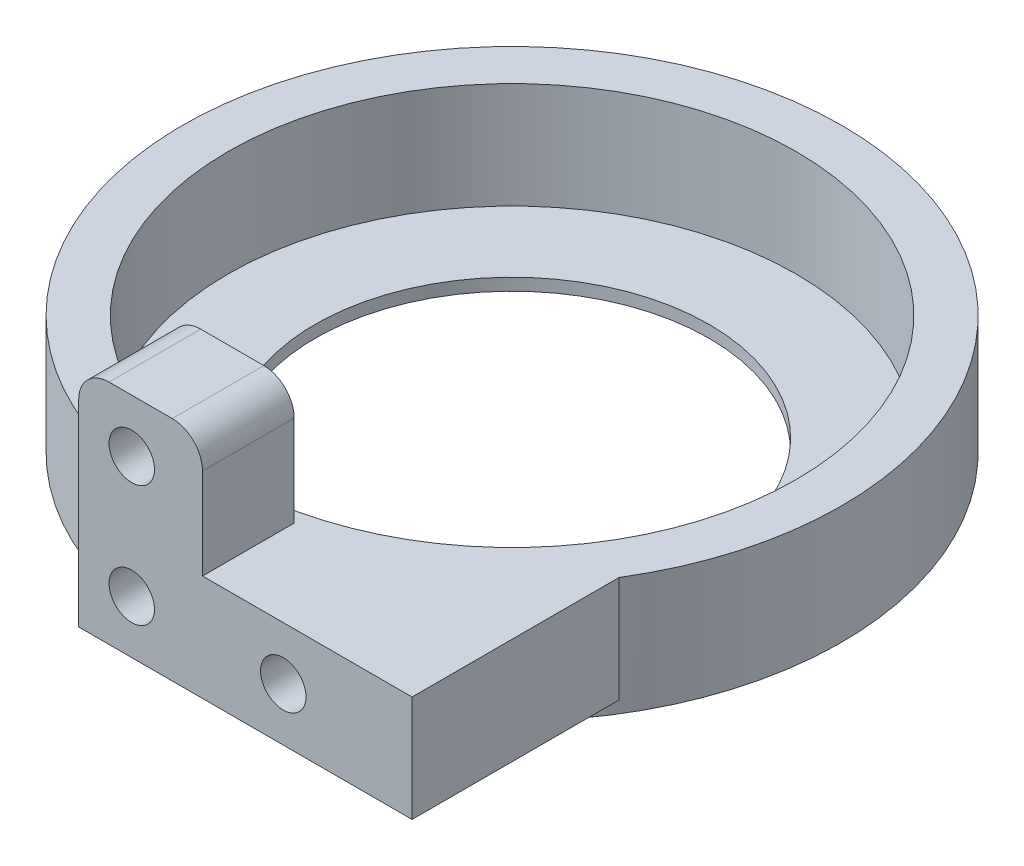
ISO-10303-21;
HEADER;
FILE_DESCRIPTION(('STEP AP214'),'2;1');
FILE_NAME('part.step','',(''),(''),'','','');
FILE_SCHEMA(('AUTOMOTIVE_DESIGN { 1 0 10303 214 1 1 1 1 }'));
ENDSEC;
DATA;
#1=APPLICATION_CONTEXT('core data for automotive mechanical design processes');
#2=APPLICATION_PROTOCOL_DEFINITION('international standard','automotive_design',2000,#1);
#3=PRODUCT_CONTEXT('',#1,'mechanical');
#4=PRODUCT('Part','Part','',(#3));
#5=PRODUCT_RELATED_PRODUCT_CATEGORY('part','',(#4));
#6=PRODUCT_DEFINITION_FORMATION('','',#4);
#7=PRODUCT_DEFINITION_CONTEXT('part definition',#1,'design');
#8=PRODUCT_DEFINITION('design','',#6,#7);
#9=PRODUCT_DEFINITION_SHAPE('','',#8);
#10=(LENGTH_UNIT() NAMED_UNIT(*) SI_UNIT(.MILLI.,.METRE.));
#11=(NAMED_UNIT(*) PLANE_ANGLE_UNIT() SI_UNIT($,.RADIAN.));
#12=(NAMED_UNIT(*) SI_UNIT($,.STERADIAN.) SOLID_ANGLE_UNIT());
#13=UNCERTAINTY_MEASURE_WITH_UNIT(LENGTH_MEASURE(1.E-05),#10,'distance_accuracy_value','');
#14=(GEOMETRIC_REPRESENTATION_CONTEXT(3) GLOBAL_UNCERTAINTY_ASSIGNED_CONTEXT((#13)) GLOBAL_UNIT_ASSIGNED_CONTEXT((#10,
#11,#12)) REPRESENTATION_CONTEXT('',''));
#15=CARTESIAN_POINT('',(0.,0.,0.));
#16=DIRECTION('',(0.,0.,1.));
#17=DIRECTION('',(1.,0.,0.));
#18=AXIS2_PLACEMENT_3D('',#15,#16,#17);
#19=CARTESIAN_POINT('',(0.,0.,0.));
#20=DIRECTION('',(0.,1.,0.));
#21=DIRECTION('',(0.,0.,1.));
#22=AXIS2_PLACEMENT_3D('',#19,#20,#21);
#23=PLANE('',#22);
#24=CARTESIAN_POINT('',(0.,0.,0.));
#25=DIRECTION('',(0.,-1.,0.));
#26=DIRECTION('',(0.,0.,-1.));
#27=AXIS2_PLACEMENT_3D('',#24,#25,#26);
#28=CIRCLE('',#27,21.75);
#29=CARTESIAN_POINT('',(18.5,0.,11.4373292336979));
#30=VERTEX_POINT('',#29);
#31=CARTESIAN_POINT('',(-3.5,0.,21.4665437367081));
#32=VERTEX_POINT('',#31);
#33=EDGE_CURVE('E193',#30,#32,#28,.T.);
#34=ORIENTED_EDGE('',*,*,#33,.F.);
#35=DIRECTION('',(0.,0.,-1.));
#36=VECTOR('',#35,1.);
#37=CARTESIAN_POINT('',(18.5,0.,25.1));
#38=LINE('',#37,#36);
#39=CARTESIAN_POINT('',(18.5,0.,25.1));
#40=VERTEX_POINT('',#39);
#41=EDGE_CURVE('E180',#40,#30,#38,.T.);
#42=ORIENTED_EDGE('',*,*,#41,.F.);
#43=DIRECTION('',(-1.,0.,0.));
#44=VECTOR('',#43,1.);
#45=CARTESIAN_POINT('',(3.5,0.,25.1));
#46=LINE('',#45,#44);
#47=CARTESIAN_POINT('',(-3.5,0.,25.1));
#48=VERTEX_POINT('',#47);
#49=EDGE_CURVE('E221',#40,#48,#46,.T.);
#50=ORIENTED_EDGE('',*,*,#49,.T.);
#51=DIRECTION('',(0.,0.,-1.));
#52=VECTOR('',#51,1.);
#53=CARTESIAN_POINT('',(-3.5,0.,25.1));
#54=LINE('',#53,#52);
#55=EDGE_CURVE('E212',#48,#32,#54,.T.);
#56=ORIENTED_EDGE('',*,*,#55,.T.);
#57=EDGE_LOOP('',(#34,#42,#50,#56));
#58=FACE_BOUND('',#57,.T.);
#59=ADVANCED_FACE('F57',(#58),#23,.F.);
#60=CARTESIAN_POINT('',(0.,7.,0.));
#61=DIRECTION('',(0.,1.,0.));
#62=DIRECTION('',(0.,0.,1.));
#63=AXIS2_PLACEMENT_3D('',#60,#61,#62);
#64=PLANE('',#63);
#65=DIRECTION('',(0.,0.,1.));
#66=VECTOR('',#65,1.);
#67=CARTESIAN_POINT('',(-3.5,7.,25.1));
#68=LINE('',#67,#66);
#69=CARTESIAN_POINT('',(-3.5,7.,19.0497576098352));
#70=VERTEX_POINT('',#69);
#71=CARTESIAN_POINT('',(-3.5,7.,21.4665437367081));
#72=VERTEX_POINT('',#71);
#73=EDGE_CURVE('E146',#70,#72,#68,.T.);
#74=ORIENTED_EDGE('',*,*,#73,.F.);
#75=DIRECTION('',(-1.,0.,0.));
#76=VECTOR('',#75,1.);
#77=CARTESIAN_POINT('',(-3.5,7.,19.0497576098352));
#78=LINE('',#77,#76);
#79=CARTESIAN_POINT('',(4.67120690078326,7.,19.0497576098352));
#80=VERTEX_POINT('',#79);
#81=EDGE_CURVE('E130',#80,#70,#78,.T.);
#82=ORIENTED_EDGE('',*,*,#81,.F.);
#83=DIRECTION('',(0.,0.,-1.));
#84=VECTOR('',#83,1.);
#85=CARTESIAN_POINT('',(4.67120690078326,7.,25.1));
#86=LINE('',#85,#84);
#87=CARTESIAN_POINT('',(4.67120690078326,7.,25.1));
#88=VERTEX_POINT('',#87);
#89=EDGE_CURVE('E143',#88,#80,#86,.T.);
#90=ORIENTED_EDGE('',*,*,#89,.F.);
#91=DIRECTION('',(-1.,0.,0.));
#92=VECTOR('',#91,1.);
#93=CARTESIAN_POINT('',(3.5,7.,25.1));
#94=LINE('',#93,#92);
#95=CARTESIAN_POINT('',(18.5,7.,25.1));
#96=VERTEX_POINT('',#95);
#97=EDGE_CURVE('E220',#96,#88,#94,.T.);
#98=ORIENTED_EDGE('',*,*,#97,.F.);
#99=DIRECTION('',(0.,0.,1.));
#100=VECTOR('',#99,1.);
#101=CARTESIAN_POINT('',(18.5,7.,25.1));
#102=LINE('',#101,#100);
#103=CARTESIAN_POINT('',(18.5,7.,11.4373292336979));
#104=VERTEX_POINT('',#103);
#105=EDGE_CURVE('E184',#104,#96,#102,.T.);
#106=ORIENTED_EDGE('',*,*,#105,.F.);
#107=CARTESIAN_POINT('',(0.,7.,0.));
#108=DIRECTION('',(0.,1.,0.));
#109=DIRECTION('',(0.,0.,1.));
#110=AXIS2_PLACEMENT_3D('',#107,#108,#109);
#111=CIRCLE('',#110,21.75);
#112=EDGE_CURVE('E217',#104,#72,#111,.T.);
#113=ORIENTED_EDGE('',*,*,#112,.T.);
#114=EDGE_LOOP('',(#74,#82,#90,#98,#106,#113));
#115=FACE_BOUND('',#114,.T.);
#116=CARTESIAN_POINT('',(0.,7.,0.));
#117=DIRECTION('',(0.,1.,0.));
#118=DIRECTION('',(0.,0.,1.));
#119=AXIS2_PLACEMENT_3D('',#116,#117,#118);
#120=CIRCLE('',#119,18.75);
#121=CARTESIAN_POINT('',(0.,7.,18.75));
#122=VERTEX_POINT('',#121);
#123=EDGE_CURVE('E208',#122,#122,#120,.T.);
#124=ORIENTED_EDGE('',*,*,#123,.F.);
#125=EDGE_LOOP('',(#124));
#126=FACE_BOUND('',#125,.T.);
#127=ADVANCED_FACE('F141',(#115,#126),#64,.T.);
#128=CARTESIAN_POINT('',(0.,7.,0.));
#129=DIRECTION('',(0.,-1.,0.));
#130=DIRECTION('',(0.,0.,-1.));
#131=AXIS2_PLACEMENT_3D('',#128,#129,#130);
#132=CYLINDRICAL_SURFACE('',#131,21.75);
#133=ORIENTED_EDGE('',*,*,#112,.F.);
#134=DIRECTION('',(0.,1.,0.));
#135=VECTOR('',#134,1.);
#136=CARTESIAN_POINT('',(18.5,0.,11.4373292336979));
#137=LINE('',#136,#135);
#138=EDGE_CURVE('E169',#30,#104,#137,.T.);
#139=ORIENTED_EDGE('',*,*,#138,.F.);
#140=ORIENTED_EDGE('',*,*,#33,.T.);
#141=DIRECTION('',(0.,-1.,0.));
#142=VECTOR('',#141,1.);
#143=CARTESIAN_POINT('',(-3.5,7.,21.4665437367081));
#144=LINE('',#143,#142);
#145=EDGE_CURVE('E233',#72,#32,#144,.T.);
#146=ORIENTED_EDGE('',*,*,#145,.F.);
#147=EDGE_LOOP('',(#133,#139,#140,#146));
#148=FACE_BOUND('',#147,.T.);
#149=CARTESIAN_POINT('',(0.,-0.8,0.));
#150=DIRECTION('',(0.,-1.,0.));
#151=DIRECTION('',(0.,0.,-1.));
#152=AXIS2_PLACEMENT_3D('',#149,#150,#151);
#153=CIRCLE('',#152,21.75);
#154=CARTESIAN_POINT('',(0.,-0.8,-21.75));
#155=VERTEX_POINT('',#154);
#156=EDGE_CURVE('E197',#155,#155,#153,.T.);
#157=ORIENTED_EDGE('',*,*,#156,.F.);
#158=EDGE_LOOP('',(#157));
#159=FACE_BOUND('',#158,.T.);
#160=ADVANCED_FACE('F304',(#148,#159),#132,.T.);
#161=CARTESIAN_POINT('',(-3.5,7.,25.1));
#162=DIRECTION('',(-1.,0.,0.));
#163=DIRECTION('',(0.,0.,1.));
#164=AXIS2_PLACEMENT_3D('',#161,#162,#163);
#165=PLANE('',#164);
#166=DIRECTION('',(0.,-1.,0.));
#167=VECTOR('',#166,1.);
#168=CARTESIAN_POINT('',(-3.5,7.,25.1));
#169=LINE('',#168,#167);
#170=CARTESIAN_POINT('',(-3.5,13.,25.1));
#171=VERTEX_POINT('',#170);
#172=EDGE_CURVE('E224',#171,#48,#169,.T.);
#173=ORIENTED_EDGE('',*,*,#172,.F.);
#174=DIRECTION('',(0.,0.,1.));
#175=VECTOR('',#174,1.);
#176=CARTESIAN_POINT('',(-3.5,13.,19.0497576098352));
#177=LINE('',#176,#175);
#178=CARTESIAN_POINT('',(-3.5,13.,19.0497576098352));
#179=VERTEX_POINT('',#178);
#180=EDGE_CURVE('E81',#171,#179,#177,.F.);
#181=ORIENTED_EDGE('',*,*,#180,.T.);
#182=DIRECTION('',(0.,-1.,0.));
#183=VECTOR('',#182,1.);
#184=CARTESIAN_POINT('',(-3.5,15.,19.0497576098352));
#185=LINE('',#184,#183);
#186=EDGE_CURVE('E136',#179,#70,#185,.T.);
#187=ORIENTED_EDGE('',*,*,#186,.T.);
#188=ORIENTED_EDGE('',*,*,#73,.T.);
#189=ORIENTED_EDGE('',*,*,#145,.T.);
#190=ORIENTED_EDGE('',*,*,#55,.F.);
#191=EDGE_LOOP('',(#173,#181,#187,#188,#189,#190));
#192=FACE_BOUND('',#191,.T.);
#193=ADVANCED_FACE('F309',(#192),#165,.T.);
#194=CARTESIAN_POINT('',(3.5,7.,25.1));
#195=DIRECTION('',(0.,0.,1.));
#196=DIRECTION('',(1.,0.,0.));
#197=AXIS2_PLACEMENT_3D('',#194,#195,#196);
#198=PLANE('',#197);
#199=CARTESIAN_POINT('',(0.,11.5,25.1));
#200=DIRECTION('',(0.,0.,1.));
#201=DIRECTION('',(1.,0.,0.));
#202=AXIS2_PLACEMENT_3D('',#199,#200,#201);
#203=CIRCLE('',#202,1.5);
#204=CARTESIAN_POINT('',(1.5,11.5,25.1));
#205=VERTEX_POINT('',#204);
#206=EDGE_CURVE('E543',#205,#205,#203,.T.);
#207=ORIENTED_EDGE('',*,*,#206,.F.);
#208=EDGE_LOOP('',(#207));
#209=FACE_BOUND('',#208,.T.);
#210=CARTESIAN_POINT('',(10.,3.5,25.1));
#211=DIRECTION('',(0.,0.,1.));
#212=DIRECTION('',(1.,0.,0.));
#213=AXIS2_PLACEMENT_3D('',#210,#211,#212);
#214=CIRCLE('',#213,1.5);
#215=CARTESIAN_POINT('',(11.5,3.5,25.1));
#216=VERTEX_POINT('',#215);
#217=EDGE_CURVE('E164',#216,#216,#214,.T.);
#218=ORIENTED_EDGE('',*,*,#217,.F.);
#219=EDGE_LOOP('',(#218));
#220=FACE_BOUND('',#219,.T.);
#221=DIRECTION('',(1.,0.,0.));
#222=VECTOR('',#221,1.);
#223=CARTESIAN_POINT('',(-3.5,15.,25.1));
#224=LINE('',#223,#222);
#225=CARTESIAN_POINT('',(-1.5,15.,25.1));
#226=VERTEX_POINT('',#225);
#227=CARTESIAN_POINT('',(2.67120690078326,15.,25.1));
#228=VERTEX_POINT('',#227);
#229=EDGE_CURVE('E148',#226,#228,#224,.T.);
#230=ORIENTED_EDGE('',*,*,#229,.F.);
#231=CARTESIAN_POINT('',(-1.5,13.,25.1));
#232=DIRECTION('',(0.,0.,1.));
#233=DIRECTION('',(1.,0.,0.));
#234=AXIS2_PLACEMENT_3D('',#231,#232,#233);
#235=CIRCLE('',#234,2.);
#236=EDGE_CURVE('E520',#226,#171,#235,.T.);
#237=ORIENTED_EDGE('',*,*,#236,.T.);
#238=ORIENTED_EDGE('',*,*,#172,.T.);
#239=ORIENTED_EDGE('',*,*,#49,.F.);
#240=DIRECTION('',(0.,-1.,0.));
#241=VECTOR('',#240,1.);
#242=CARTESIAN_POINT('',(18.5,7.,25.1));
#243=LINE('',#242,#241);
#244=EDGE_CURVE('E176',#96,#40,#243,.T.);
#245=ORIENTED_EDGE('',*,*,#244,.F.);
#246=ORIENTED_EDGE('',*,*,#97,.T.);
#247=DIRECTION('',(0.,-1.,0.));
#248=VECTOR('',#247,1.);
#249=CARTESIAN_POINT('',(4.67120690078326,15.,25.1));
#250=LINE('',#249,#248);
#251=CARTESIAN_POINT('',(4.67120690078326,13.,25.1));
#252=VERTEX_POINT('',#251);
#253=EDGE_CURVE('E135',#252,#88,#250,.T.);
#254=ORIENTED_EDGE('',*,*,#253,.F.);
#255=CARTESIAN_POINT('',(2.67120690078326,13.,25.1));
#256=DIRECTION('',(0.,0.,1.));
#257=DIRECTION('',(1.,0.,0.));
#258=AXIS2_PLACEMENT_3D('',#255,#256,#257);
#259=CIRCLE('',#258,2.);
#260=EDGE_CURVE('E514',#252,#228,#259,.T.);
#261=ORIENTED_EDGE('',*,*,#260,.T.);
#262=EDGE_LOOP('',(#230,#237,#238,#239,#245,#246,#254,#261));
#263=FACE_BOUND('',#262,.T.);
#264=CARTESIAN_POINT('',(0.,3.5,25.1));
#265=DIRECTION('',(0.,0.,1.));
#266=DIRECTION('',(1.,0.,0.));
#267=AXIS2_PLACEMENT_3D('',#264,#265,#266);
#268=CIRCLE('',#267,1.5);
#269=CARTESIAN_POINT('',(1.5,3.5,25.1));
#270=VERTEX_POINT('',#269);
#271=EDGE_CURVE('E201',#270,#270,#268,.T.);
#272=ORIENTED_EDGE('',*,*,#271,.F.);
#273=EDGE_LOOP('',(#272));
#274=FACE_BOUND('',#273,.T.);
#275=ADVANCED_FACE('F306',(#209,#220,#263,#274),#198,.T.);
#276=CARTESIAN_POINT('',(0.,7.,0.));
#277=DIRECTION('',(0.,-1.,0.));
#278=DIRECTION('',(0.,0.,-1.));
#279=AXIS2_PLACEMENT_3D('',#276,#277,#278);
#280=CYLINDRICAL_SURFACE('',#279,18.75);
#281=CARTESIAN_POINT('',(1.5,3.5,18.6899036915657));
#282=CARTESIAN_POINT('',(1.49999632062772,3.41588910974437,18.6899044892014));
#283=CARTESIAN_POINT('',(1.49290156215183,3.3317206652062,18.6904775942158));
#284=CARTESIAN_POINT('',(1.46470318774386,3.16571175768858,18.6927081206783));
#285=CARTESIAN_POINT('',(1.44358362109166,3.08387405616433,18.6943667767162));
#286=CARTESIAN_POINT('',(1.38794959023862,2.92495508136651,18.6985793452206));
#287=CARTESIAN_POINT('',(1.35344262614257,2.84787117282067,18.7011327563356));
#288=CARTESIAN_POINT('',(1.27202646042832,2.70060821925846,18.7068465005001));
#289=CARTESIAN_POINT('',(1.22511994393665,2.630427683824,18.7100067021084));
#290=CARTESIAN_POINT('',(1.12011551831489,2.49877819168836,18.7165863916315));
#291=CARTESIAN_POINT('',(1.06199424933048,2.43732789187484,18.7200064115608));
#292=CARTESIAN_POINT('',(0.936259445760343,2.32504341460093,18.7267155033906));
#293=CARTESIAN_POINT('',(0.868645500088394,2.27420969713547,18.7300045696121));
#294=CARTESIAN_POINT('',(0.725734168475946,2.18453992472742,18.7360861453358));
#295=CARTESIAN_POINT('',(0.650426681655086,2.14571991903267,18.738877988498));
#296=CARTESIAN_POINT('',(0.494336491088885,2.08128219450257,18.7436448358792));
#297=CARTESIAN_POINT('',(0.413553876517281,2.05566426070272,18.745619853398));
#298=CARTESIAN_POINT('',(0.248991495760869,2.01841132760336,18.7485268054688));
#299=CARTESIAN_POINT('',(0.165218575252358,2.00674626571047,18.7494609822974));
#300=CARTESIAN_POINT('',(-0.00310101422522166,1.99763728747693,18.7501885880184));
#301=CARTESIAN_POINT('',(-0.0876476697940369,2.00019312530925,18.7499820366297));
#302=CARTESIAN_POINT('',(-0.254910958845742,2.01942877416144,18.7484533122186));
#303=CARTESIAN_POINT('',(-0.337631336820587,2.03607625616637,18.7471336928186));
#304=CARTESIAN_POINT('',(-0.499099950189813,2.08297238129014,18.7435302217384));
#305=CARTESIAN_POINT('',(-0.577848150305161,2.11322114518559,18.7412463614959));
#306=CARTESIAN_POINT('',(-0.729240075628612,2.18649731782168,18.7359669873138));
#307=CARTESIAN_POINT('',(-0.801876748665349,2.22953923615441,18.7329706660993));
#308=CARTESIAN_POINT('',(-0.938906754389632,2.32716937813201,18.7266031809033));
#309=CARTESIAN_POINT('',(-1.00329993315168,2.38175781732721,18.7232320099247));
#310=CARTESIAN_POINT('',(-1.12220402922705,2.50111371219672,18.716482638835));
#311=CARTESIAN_POINT('',(-1.17668675797546,2.56590925405083,18.7131044454878));
#312=CARTESIAN_POINT('',(-1.27400569041641,2.70374207490187,18.7067312907922));
#313=CARTESIAN_POINT('',(-1.31684188556444,2.77677935994532,18.7037363297249));
#314=CARTESIAN_POINT('',(-1.38965054864154,2.92904186429338,18.6984681334495));
#315=CARTESIAN_POINT('',(-1.41962160308561,3.00826776240737,18.6961949775527));
#316=CARTESIAN_POINT('',(-1.46582859989257,3.17064933913142,18.6926292502436));
#317=CARTESIAN_POINT('',(-1.48206480809471,3.25380494164879,18.6913366598524));
#318=CARTESIAN_POINT('',(-1.50030564278629,3.4214389223715,18.6898814380755));
#319=CARTESIAN_POINT('',(-1.50234955607957,3.50591299971711,18.6897156874231));
#320=CARTESIAN_POINT('',(-1.49225064585172,3.67400262104635,18.690524676209));
#321=CARTESIAN_POINT('',(-1.48010794413208,3.75761817239478,18.6914994058556));
#322=CARTESIAN_POINT('',(-1.44201322164018,3.92150472101421,18.6944766801575));
#323=CARTESIAN_POINT('',(-1.41607949196744,4.00177999680187,18.6964778632987));
#324=CARTESIAN_POINT('',(-1.35115745890298,4.15683972413565,18.7012814234103));
#325=CARTESIAN_POINT('',(-1.31216896221481,4.23162409436024,18.7040838122436));
#326=CARTESIAN_POINT('',(-1.22214454706965,4.373759059463,18.7101815822911));
#327=CARTESIAN_POINT('',(-1.17108242281578,4.44109300986021,18.7134780300796));
#328=CARTESIAN_POINT('',(-1.05839811840015,4.5662476479122,18.7201888557784));
#329=CARTESIAN_POINT('',(-0.996775770633618,4.62406818454792,18.7236032355598));
#330=CARTESIAN_POINT('',(-0.864550602263586,4.72868853250665,18.7301744660023));
#331=CARTESIAN_POINT('',(-0.793927565253147,4.77546283652398,18.7333307098241));
#332=CARTESIAN_POINT('',(-0.645806640765806,4.85648803992158,18.7390213036078));
#333=CARTESIAN_POINT('',(-0.568308817352759,4.89073905598699,18.7415556593639));
#334=CARTESIAN_POINT('',(-0.408730022480179,4.94570151548968,18.7457141148762));
#335=CARTESIAN_POINT('',(-0.326654535286603,4.96642879824313,18.7473392791795));
#336=CARTESIAN_POINT('',(-0.160174833719194,4.99380720003187,18.7495005498768));
#337=CARTESIAN_POINT('',(-0.0757706596510529,5.00045856254326,18.7500366751083));
#338=CARTESIAN_POINT('',(0.0927188866521085,4.99949357241986,18.7499594956931));
#339=CARTESIAN_POINT('',(0.176804491059185,4.99191700058234,18.7493493958487));
#340=CARTESIAN_POINT('',(0.342505049325764,4.96279408533884,18.7470546664287));
#341=CARTESIAN_POINT('',(0.424119999621,4.94124772178048,18.7453700353031));
#342=CARTESIAN_POINT('',(0.58256563894844,4.88480677611825,18.7411153164152));
#343=CARTESIAN_POINT('',(0.6593965525984,4.8499128212543,18.7385452702617));
#344=CARTESIAN_POINT('',(0.806115934271487,4.76777187152803,18.7328074295552));
#345=CARTESIAN_POINT('',(0.8760045245382,4.72052509423304,18.7296396455302));
#346=CARTESIAN_POINT('',(1.00705879886138,4.61487049786707,18.7230514806532));
#347=CARTESIAN_POINT('',(1.06820077293534,4.55643330967203,18.7196304499822));
#348=CARTESIAN_POINT('',(1.17983224819666,4.43010829215942,18.7129268703636));
#349=CARTESIAN_POINT('',(1.23031916134281,4.36221817342083,18.709644355215));
#350=CARTESIAN_POINT('',(1.31927004620408,4.21879254913323,18.7035831840147));
#351=CARTESIAN_POINT('',(1.35771272607774,4.14324381313022,18.7008054238702));
#352=CARTESIAN_POINT('',(1.42131855200279,3.98679387767989,18.6960792751499));
#353=CARTESIAN_POINT('',(1.44649701682099,3.90589897459956,18.6941299303474));
#354=CARTESIAN_POINT('',(1.47642337958161,3.77043630193827,18.691784377361));
#355=CARTESIAN_POINT('',(1.48525291732771,3.71674059854125,18.6910823459044));
#356=CARTESIAN_POINT('',(1.49704240943925,3.60870461027899,18.6901417457999));
#357=CARTESIAN_POINT('',(1.5000023781296,3.55436432698718,18.6899031760209));
#358=CARTESIAN_POINT('',(1.5,3.5,18.6899036915657));
#359=B_SPLINE_CURVE_WITH_KNOTS('',3,(#281,#282,#283,#284,#285,#286,#287,#288,#289,#290,#291,
#292,#293,#294,#295,#296,#297,#298,#299,#300,#301,#302,#303,#304,#305,#306,#307,#308,#309,#310,
#311,#312,#313,#314,#315,#316,#317,#318,#319,#320,#321,#322,#323,#324,#325,#326,#327,#328,#329,
#330,#331,#332,#333,#334,#335,#336,#337,#338,#339,#340,#341,#342,#343,#344,#345,#346,#347,#348,
#349,#350,#351,#352,#353,#354,#355,#356,#357,#358),.UNSPECIFIED.,.T.,.F.,(4,2,2,2,2,2,2,2,2,2,2,
2,2,2,2,2,2,2,2,2,2,2,2,2,2,2,2,2,2,2,2,2,2,2,2,2,2,2,4),(0.,0.25213418203791,0.50455561402385,
0.756835834120728,1.00906146755583,1.26181826116902,1.51458600394927,1.7676899785965,
2.02078983191417,2.27334337309686,2.52589254857181,2.77786389180794,3.02983747254223,
3.28209793140011,3.53436309986935,3.78733494058949,4.0403069669025,4.29330677998519,
4.54630169612057,4.79859599700462,5.05088813179099,5.30284648195618,5.55480856292754,
5.80732263043169,6.05984070604075,6.31293630132195,6.56602953833693,6.8188258119051,
7.07161771273227,7.32370386856552,7.5757903880512,7.82786506275495,8.07993529802616,
8.33267638790938,8.5854787963961,8.83872562068804,9.09167932690653,9.25464441416333,
9.41760910369755),.UNSPECIFIED.);
#360=CARTESIAN_POINT('',(1.5,3.5,18.6899036915657));
#361=VERTEX_POINT('',#360);
#362=EDGE_CURVE('E207',#361,#361,#359,.T.);
#363=ORIENTED_EDGE('',*,*,#362,.F.);
#364=EDGE_LOOP('',(#363));
#365=FACE_BOUND('',#364,.T.);
#366=ORIENTED_EDGE('',*,*,#123,.T.);
#367=EDGE_LOOP('',(#366));
#368=FACE_BOUND('',#367,.T.);
#369=CARTESIAN_POINT('',(0.,0.,0.));
#370=DIRECTION('',(0.,1.,0.));
#371=DIRECTION('',(0.,0.,1.));
#372=AXIS2_PLACEMENT_3D('',#369,#370,#371);
#373=CIRCLE('',#372,18.75);
#374=CARTESIAN_POINT('',(0.,0.,18.75));
#375=VERTEX_POINT('',#374);
#376=EDGE_CURVE('E213',#375,#375,#373,.T.);
#377=ORIENTED_EDGE('',*,*,#376,.F.);
#378=EDGE_LOOP('',(#377));
#379=FACE_BOUND('',#378,.T.);
#380=ADVANCED_FACE('F247',(#365,#368,#379),#280,.F.);
#381=CARTESIAN_POINT('',(0.,3.5,18.1));
#382=DIRECTION('',(0.,0.,1.));
#383=DIRECTION('',(1.,0.,0.));
#384=AXIS2_PLACEMENT_3D('',#381,#382,#383);
#385=CYLINDRICAL_SURFACE('',#384,1.5);
#386=ORIENTED_EDGE('',*,*,#362,.T.);
#387=EDGE_LOOP('',(#386));
#388=FACE_BOUND('',#387,.T.);
#389=ORIENTED_EDGE('',*,*,#271,.T.);
#390=EDGE_LOOP('',(#389));
#391=FACE_BOUND('',#390,.T.);
#392=ADVANCED_FACE('F250',(#388,#391),#385,.F.);
#393=CARTESIAN_POINT('',(0.,0.,0.));
#394=DIRECTION('',(0.,-1.,0.));
#395=DIRECTION('',(0.,0.,-1.));
#396=AXIS2_PLACEMENT_3D('',#393,#394,#395);
#397=PLANE('',#396);
#398=CARTESIAN_POINT('',(0.,0.,0.));
#399=DIRECTION('',(0.,-1.,0.));
#400=DIRECTION('',(0.,0.,-1.));
#401=AXIS2_PLACEMENT_3D('',#398,#399,#400);
#402=CIRCLE('',#401,13.);
#403=CARTESIAN_POINT('',(0.,0.,-13.));
#404=VERTEX_POINT('',#403);
#405=EDGE_CURVE('E188',#404,#404,#402,.T.);
#406=ORIENTED_EDGE('',*,*,#405,.T.);
#407=EDGE_LOOP('',(#406));
#408=FACE_BOUND('',#407,.T.);
#409=ORIENTED_EDGE('',*,*,#376,.T.);
#410=EDGE_LOOP('',(#409));
#411=FACE_BOUND('',#410,.T.);
#412=ADVANCED_FACE('F254',(#408,#411),#397,.F.);
#413=CARTESIAN_POINT('',(0.,-0.8,0.));
#414=DIRECTION('',(0.,-1.,0.));
#415=DIRECTION('',(0.,0.,-1.));
#416=AXIS2_PLACEMENT_3D('',#413,#414,#415);
#417=PLANE('',#416);
#418=ORIENTED_EDGE('',*,*,#156,.T.);
#419=EDGE_LOOP('',(#418));
#420=FACE_BOUND('',#419,.T.);
#421=CARTESIAN_POINT('',(0.,-0.8,0.));
#422=DIRECTION('',(0.,-1.,0.));
#423=DIRECTION('',(0.,0.,-1.));
#424=AXIS2_PLACEMENT_3D('',#421,#422,#423);
#425=CIRCLE('',#424,13.);
#426=CARTESIAN_POINT('',(0.,-0.8,-13.));
#427=VERTEX_POINT('',#426);
#428=EDGE_CURVE('E189',#427,#427,#425,.T.);
#429=ORIENTED_EDGE('',*,*,#428,.F.);
#430=EDGE_LOOP('',(#429));
#431=FACE_BOUND('',#430,.T.);
#432=ADVANCED_FACE('F258',(#420,#431),#417,.T.);
#433=CARTESIAN_POINT('',(0.,-0.8,0.));
#434=DIRECTION('',(0.,1.,0.));
#435=DIRECTION('',(0.,0.,1.));
#436=AXIS2_PLACEMENT_3D('',#433,#434,#435);
#437=CYLINDRICAL_SURFACE('',#436,13.);
#438=ORIENTED_EDGE('',*,*,#428,.T.);
#439=EDGE_LOOP('',(#438));
#440=FACE_BOUND('',#439,.T.);
#441=ORIENTED_EDGE('',*,*,#405,.F.);
#442=EDGE_LOOP('',(#441));
#443=FACE_BOUND('',#442,.T.);
#444=ADVANCED_FACE('F262',(#440,#443),#437,.F.);
#445=CARTESIAN_POINT('',(18.5,0.,0.));
#446=DIRECTION('',(1.,0.,0.));
#447=DIRECTION('',(0.,0.,-1.));
#448=AXIS2_PLACEMENT_3D('',#445,#446,#447);
#449=PLANE('',#448);
#450=ORIENTED_EDGE('',*,*,#244,.T.);
#451=ORIENTED_EDGE('',*,*,#41,.T.);
#452=ORIENTED_EDGE('',*,*,#138,.T.);
#453=ORIENTED_EDGE('',*,*,#105,.T.);
#454=EDGE_LOOP('',(#450,#451,#452,#453));
#455=FACE_BOUND('',#454,.T.);
#456=ADVANCED_FACE('F266',(#455),#449,.T.);
#457=CARTESIAN_POINT('',(10.,3.5,19.1));
#458=DIRECTION('',(0.,0.,1.));
#459=DIRECTION('',(1.,0.,0.));
#460=AXIS2_PLACEMENT_3D('',#457,#458,#459);
#461=CYLINDRICAL_SURFACE('',#460,1.5);
#462=CARTESIAN_POINT('',(10.,3.5,19.1));
#463=DIRECTION('',(0.,0.,1.));
#464=DIRECTION('',(1.,0.,0.));
#465=AXIS2_PLACEMENT_3D('',#462,#463,#464);
#466=CIRCLE('',#465,1.5);
#467=CARTESIAN_POINT('',(11.5,3.5,19.1));
#468=VERTEX_POINT('',#467);
#469=EDGE_CURVE('E165',#468,#468,#466,.T.);
#470=ORIENTED_EDGE('',*,*,#469,.F.);
#471=EDGE_LOOP('',(#470));
#472=FACE_BOUND('',#471,.T.);
#473=ORIENTED_EDGE('',*,*,#217,.T.);
#474=EDGE_LOOP('',(#473));
#475=FACE_BOUND('',#474,.T.);
#476=ADVANCED_FACE('F270',(#472,#475),#461,.F.);
#477=CARTESIAN_POINT('',(10.,3.5,19.1));
#478=DIRECTION('',(0.,0.,1.));
#479=DIRECTION('',(1.,0.,0.));
#480=AXIS2_PLACEMENT_3D('',#477,#478,#479);
#481=PLANE('',#480);
#482=ORIENTED_EDGE('',*,*,#469,.T.);
#483=EDGE_LOOP('',(#482));
#484=FACE_BOUND('',#483,.T.);
#485=ADVANCED_FACE('F274',(#484),#481,.T.);
#486=CARTESIAN_POINT('',(4.67120690078326,15.,25.1));
#487=DIRECTION('',(-1.,0.,0.));
#488=DIRECTION('',(0.,0.,1.));
#489=AXIS2_PLACEMENT_3D('',#486,#487,#488);
#490=PLANE('',#489);
#491=DIRECTION('',(0.,-1.,0.));
#492=VECTOR('',#491,1.);
#493=CARTESIAN_POINT('',(4.67120690078326,15.,19.0497576098352));
#494=LINE('',#493,#492);
#495=CARTESIAN_POINT('',(4.67120690078326,13.,19.0497576098352));
#496=VERTEX_POINT('',#495);
#497=EDGE_CURVE('E127',#496,#80,#494,.T.);
#498=ORIENTED_EDGE('',*,*,#497,.F.);
#499=DIRECTION('',(0.,0.,-1.));
#500=VECTOR('',#499,1.);
#501=CARTESIAN_POINT('',(4.67120690078326,13.,25.1));
#502=LINE('',#501,#500);
#503=EDGE_CURVE('E12',#496,#252,#502,.F.);
#504=ORIENTED_EDGE('',*,*,#503,.T.);
#505=ORIENTED_EDGE('',*,*,#253,.T.);
#506=ORIENTED_EDGE('',*,*,#89,.T.);
#507=EDGE_LOOP('',(#498,#504,#505,#506));
#508=FACE_BOUND('',#507,.T.);
#509=ADVANCED_FACE('F150',(#508),#490,.F.);
#510=CARTESIAN_POINT('',(-3.5,15.,19.0497576098352));
#511=DIRECTION('',(0.,0.,1.));
#512=DIRECTION('',(1.,0.,0.));
#513=AXIS2_PLACEMENT_3D('',#510,#511,#512);
#514=PLANE('',#513);
#515=CARTESIAN_POINT('',(0.,11.5,19.0497576098352));
#516=DIRECTION('',(0.,0.,1.));
#517=DIRECTION('',(1.,0.,0.));
#518=AXIS2_PLACEMENT_3D('',#515,#516,#517);
#519=CIRCLE('',#518,1.5);
#520=CARTESIAN_POINT('',(1.5,11.5,19.0497576098352));
#521=VERTEX_POINT('',#520);
#522=EDGE_CURVE('E155',#521,#521,#519,.T.);
#523=ORIENTED_EDGE('',*,*,#522,.T.);
#524=EDGE_LOOP('',(#523));
#525=FACE_BOUND('',#524,.T.);
#526=ORIENTED_EDGE('',*,*,#186,.F.);
#527=CARTESIAN_POINT('',(-1.5,13.,19.0497576098352));
#528=DIRECTION('',(0.,0.,1.));
#529=DIRECTION('',(1.,0.,0.));
#530=AXIS2_PLACEMENT_3D('',#527,#528,#529);
#531=CIRCLE('',#530,2.);
#532=CARTESIAN_POINT('',(-1.5,15.,19.0497576098352));
#533=VERTEX_POINT('',#532);
#534=EDGE_CURVE('E66',#179,#533,#531,.F.);
#535=ORIENTED_EDGE('',*,*,#534,.T.);
#536=DIRECTION('',(-1.,0.,0.));
#537=VECTOR('',#536,1.);
#538=CARTESIAN_POINT('',(-3.5,15.,19.0497576098352));
#539=LINE('',#538,#537);
#540=CARTESIAN_POINT('',(2.67120690078326,15.,19.0497576098352));
#541=VERTEX_POINT('',#540);
#542=EDGE_CURVE('E160',#541,#533,#539,.T.);
#543=ORIENTED_EDGE('',*,*,#542,.F.);
#544=CARTESIAN_POINT('',(2.67120690078326,13.,19.0497576098352));
#545=DIRECTION('',(0.,0.,1.));
#546=DIRECTION('',(1.,0.,0.));
#547=AXIS2_PLACEMENT_3D('',#544,#545,#546);
#548=CIRCLE('',#547,2.);
#549=EDGE_CURVE('E73',#541,#496,#548,.F.);
#550=ORIENTED_EDGE('',*,*,#549,.T.);
#551=ORIENTED_EDGE('',*,*,#497,.T.);
#552=ORIENTED_EDGE('',*,*,#81,.T.);
#553=EDGE_LOOP('',(#526,#535,#543,#550,#551,#552));
#554=FACE_BOUND('',#553,.T.);
#555=ADVANCED_FACE('F129',(#525,#554),#514,.F.);
#556=CARTESIAN_POINT('',(0.,15.,0.));
#557=DIRECTION('',(0.,-1.,0.));
#558=DIRECTION('',(0.,0.,-1.));
#559=AXIS2_PLACEMENT_3D('',#556,#557,#558);
#560=PLANE('',#559);
#561=ORIENTED_EDGE('',*,*,#542,.T.);
#562=DIRECTION('',(0.,0.,1.));
#563=VECTOR('',#562,1.);
#564=CARTESIAN_POINT('',(-1.5,15.,25.1));
#565=LINE('',#564,#563);
#566=EDGE_CURVE('E521',#533,#226,#565,.T.);
#567=ORIENTED_EDGE('',*,*,#566,.T.);
#568=ORIENTED_EDGE('',*,*,#229,.T.);
#569=DIRECTION('',(0.,0.,-1.));
#570=VECTOR('',#569,1.);
#571=CARTESIAN_POINT('',(2.67120690078326,15.,0.));
#572=LINE('',#571,#570);
#573=EDGE_CURVE('E237',#228,#541,#572,.T.);
#574=ORIENTED_EDGE('',*,*,#573,.T.);
#575=EDGE_LOOP('',(#561,#567,#568,#574));
#576=FACE_BOUND('',#575,.T.);
#577=ADVANCED_FACE('F283',(#576),#560,.F.);
#578=CARTESIAN_POINT('',(0.,11.5,15.1));
#579=DIRECTION('',(0.,0.,1.));
#580=DIRECTION('',(1.,0.,0.));
#581=AXIS2_PLACEMENT_3D('',#578,#579,#580);
#582=CYLINDRICAL_SURFACE('',#581,1.5);
#583=ORIENTED_EDGE('',*,*,#206,.T.);
#584=EDGE_LOOP('',(#583));
#585=FACE_BOUND('',#584,.T.);
#586=ORIENTED_EDGE('',*,*,#522,.F.);
#587=EDGE_LOOP('',(#586));
#588=FACE_BOUND('',#587,.T.);
#589=ADVANCED_FACE('F287',(#585,#588),#582,.F.);
#590=CARTESIAN_POINT('',(-1.5,13.,0.));
#591=DIRECTION('',(0.,0.,-1.));
#592=DIRECTION('',(-1.,0.,0.));
#593=AXIS2_PLACEMENT_3D('',#590,#591,#592);
#594=CYLINDRICAL_SURFACE('',#593,2.);
#595=ORIENTED_EDGE('',*,*,#534,.F.);
#596=ORIENTED_EDGE('',*,*,#180,.F.);
#597=ORIENTED_EDGE('',*,*,#236,.F.);
#598=ORIENTED_EDGE('',*,*,#566,.F.);
#599=EDGE_LOOP('',(#595,#596,#597,#598));
#600=FACE_BOUND('',#599,.T.);
#601=ADVANCED_FACE('F290',(#600),#594,.T.);
#602=CARTESIAN_POINT('',(2.67120690078326,13.,0.));
#603=DIRECTION('',(0.,0.,-1.));
#604=DIRECTION('',(-1.,0.,0.));
#605=AXIS2_PLACEMENT_3D('',#602,#603,#604);
#606=CYLINDRICAL_SURFACE('',#605,2.);
#607=ORIENTED_EDGE('',*,*,#260,.F.);
#608=ORIENTED_EDGE('',*,*,#503,.F.);
#609=ORIENTED_EDGE('',*,*,#549,.F.);
#610=ORIENTED_EDGE('',*,*,#573,.F.);
#611=EDGE_LOOP('',(#607,#608,#609,#610));
#612=FACE_BOUND('',#611,.T.);
#613=ADVANCED_FACE('F59',(#612),#606,.T.);
#614=CLOSED_SHELL('',(#59,#127,#160,#193,#275,#380,#392,#412,#432,#444,#456,#476,#485,#509,#555,
#577,#589,#601,#613));
#615=MANIFOLD_SOLID_BREP('B2',#614);
#616=ADVANCED_BREP_SHAPE_REPRESENTATION('',(#18,#615),#14);
#617=SHAPE_DEFINITION_REPRESENTATION(#9,#616);
ENDSEC;
END-ISO-10303-21;
